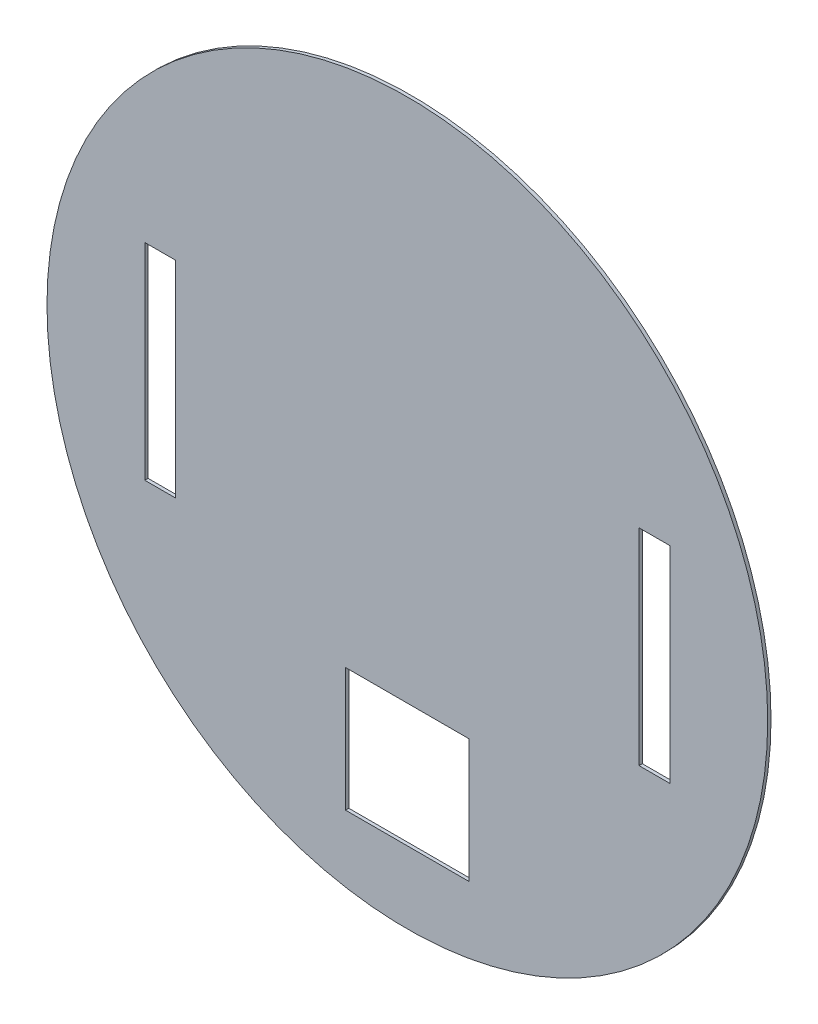
ISO-10303-21;
HEADER;
FILE_DESCRIPTION(('STEP AP214'),'2;1');
FILE_NAME('part.step','',(''),(''),'','','');
FILE_SCHEMA(('AUTOMOTIVE_DESIGN { 1 0 10303 214 1 1 1 1 }'));
ENDSEC;
DATA;
#1=APPLICATION_CONTEXT('core data for automotive mechanical design processes');
#2=APPLICATION_PROTOCOL_DEFINITION('international standard','automotive_design',2000,#1);
#3=PRODUCT_CONTEXT('',#1,'mechanical');
#4=PRODUCT('Part','Part','',(#3));
#5=PRODUCT_RELATED_PRODUCT_CATEGORY('part','',(#4));
#6=PRODUCT_DEFINITION_FORMATION('','',#4);
#7=PRODUCT_DEFINITION_CONTEXT('part definition',#1,'design');
#8=PRODUCT_DEFINITION('design','',#6,#7);
#9=PRODUCT_DEFINITION_SHAPE('','',#8);
#10=(LENGTH_UNIT() NAMED_UNIT(*) SI_UNIT(.MILLI.,.METRE.));
#11=(NAMED_UNIT(*) PLANE_ANGLE_UNIT() SI_UNIT($,.RADIAN.));
#12=(NAMED_UNIT(*) SI_UNIT($,.STERADIAN.) SOLID_ANGLE_UNIT());
#13=UNCERTAINTY_MEASURE_WITH_UNIT(LENGTH_MEASURE(1.E-05),#10,'distance_accuracy_value','');
#14=(GEOMETRIC_REPRESENTATION_CONTEXT(3) GLOBAL_UNCERTAINTY_ASSIGNED_CONTEXT((#13)) GLOBAL_UNIT_ASSIGNED_CONTEXT((#10,
#11,#12)) REPRESENTATION_CONTEXT('',''));
#15=CARTESIAN_POINT('',(0.,0.,0.));
#16=DIRECTION('',(0.,0.,1.));
#17=DIRECTION('',(1.,0.,0.));
#18=AXIS2_PLACEMENT_3D('',#15,#16,#17);
#19=CARTESIAN_POINT('',(0.,0.,1.6));
#20=DIRECTION('',(0.,0.,-1.));
#21=DIRECTION('',(-1.,0.,0.));
#22=AXIS2_PLACEMENT_3D('',#19,#20,#21);
#23=CYLINDRICAL_SURFACE('',#22,175.);
#24=CARTESIAN_POINT('',(0.,0.,1.6));
#25=DIRECTION('',(0.,0.,1.));
#26=DIRECTION('',(1.,0.,0.));
#27=AXIS2_PLACEMENT_3D('',#24,#25,#26);
#28=CIRCLE('',#27,175.);
#29=CARTESIAN_POINT('',(175.,0.,1.6));
#30=VERTEX_POINT('',#29);
#31=EDGE_CURVE('E11',#30,#30,#28,.T.);
#32=ORIENTED_EDGE('',*,*,#31,.F.);
#33=EDGE_LOOP('',(#32));
#34=FACE_BOUND('',#33,.T.);
#35=CARTESIAN_POINT('',(0.,0.,0.));
#36=DIRECTION('',(0.,0.,1.));
#37=DIRECTION('',(1.,0.,0.));
#38=AXIS2_PLACEMENT_3D('',#35,#36,#37);
#39=CIRCLE('',#38,175.);
#40=CARTESIAN_POINT('',(175.,0.,0.));
#41=VERTEX_POINT('',#40);
#42=EDGE_CURVE('E36',#41,#41,#39,.T.);
#43=ORIENTED_EDGE('',*,*,#42,.T.);
#44=EDGE_LOOP('',(#43));
#45=FACE_BOUND('',#44,.T.);
#46=ADVANCED_FACE('F33',(#34,#45),#23,.T.);
#47=CARTESIAN_POINT('',(0.,0.,1.6));
#48=DIRECTION('',(0.,0.,1.));
#49=DIRECTION('',(1.,0.,0.));
#50=AXIS2_PLACEMENT_3D('',#47,#48,#49);
#51=PLANE('',#50);
#52=DIRECTION('',(0.,-1.,0.));
#53=VECTOR('',#52,1.);
#54=CARTESIAN_POINT('',(-30.,-80.,1.6));
#55=LINE('',#54,#53);
#56=CARTESIAN_POINT('',(-30.,-80.,1.6));
#57=VERTEX_POINT('',#56);
#58=CARTESIAN_POINT('',(-30.,-140.,1.6));
#59=VERTEX_POINT('',#58);
#60=EDGE_CURVE('E47',#57,#59,#55,.T.);
#61=ORIENTED_EDGE('',*,*,#60,.F.);
#62=DIRECTION('',(-1.,0.,0.));
#63=VECTOR('',#62,1.);
#64=CARTESIAN_POINT('',(-30.,-80.,1.6));
#65=LINE('',#64,#63);
#66=CARTESIAN_POINT('',(30.,-80.,1.6));
#67=VERTEX_POINT('',#66);
#68=EDGE_CURVE('E139',#67,#57,#65,.T.);
#69=ORIENTED_EDGE('',*,*,#68,.F.);
#70=DIRECTION('',(0.,1.,0.));
#71=VECTOR('',#70,1.);
#72=CARTESIAN_POINT('',(30.,-80.,1.6));
#73=LINE('',#72,#71);
#74=CARTESIAN_POINT('',(30.,-140.,1.6));
#75=VERTEX_POINT('',#74);
#76=EDGE_CURVE('E142',#75,#67,#73,.T.);
#77=ORIENTED_EDGE('',*,*,#76,.F.);
#78=DIRECTION('',(1.,0.,0.));
#79=VECTOR('',#78,1.);
#80=CARTESIAN_POINT('',(-30.,-140.,1.6));
#81=LINE('',#80,#79);
#82=EDGE_CURVE('E148',#59,#75,#81,.T.);
#83=ORIENTED_EDGE('',*,*,#82,.F.);
#84=EDGE_LOOP('',(#61,#69,#77,#83));
#85=FACE_BOUND('',#84,.T.);
#86=DIRECTION('',(0.,-1.,0.));
#87=VECTOR('',#86,1.);
#88=CARTESIAN_POINT('',(-127.5,50.,1.6));
#89=LINE('',#88,#87);
#90=CARTESIAN_POINT('',(-127.5,50.,1.6));
#91=VERTEX_POINT('',#90);
#92=CARTESIAN_POINT('',(-127.5,-50.,1.6));
#93=VERTEX_POINT('',#92);
#94=EDGE_CURVE('E172',#91,#93,#89,.T.);
#95=ORIENTED_EDGE('',*,*,#94,.F.);
#96=DIRECTION('',(-1.,0.,0.));
#97=VECTOR('',#96,1.);
#98=CARTESIAN_POINT('',(-127.5,50.,1.6));
#99=LINE('',#98,#97);
#100=CARTESIAN_POINT('',(-112.5,50.,1.6));
#101=VERTEX_POINT('',#100);
#102=EDGE_CURVE('E162',#101,#91,#99,.T.);
#103=ORIENTED_EDGE('',*,*,#102,.F.);
#104=DIRECTION('',(0.,1.,0.));
#105=VECTOR('',#104,1.);
#106=CARTESIAN_POINT('',(-112.5,50.,1.6));
#107=LINE('',#106,#105);
#108=CARTESIAN_POINT('',(-112.5,-50.,1.6));
#109=VERTEX_POINT('',#108);
#110=EDGE_CURVE('E178',#109,#101,#107,.T.);
#111=ORIENTED_EDGE('',*,*,#110,.F.);
#112=DIRECTION('',(1.,0.,0.));
#113=VECTOR('',#112,1.);
#114=CARTESIAN_POINT('',(-127.5,-50.,1.6));
#115=LINE('',#114,#113);
#116=EDGE_CURVE('E174',#93,#109,#115,.T.);
#117=ORIENTED_EDGE('',*,*,#116,.F.);
#118=EDGE_LOOP('',(#95,#103,#111,#117));
#119=FACE_BOUND('',#118,.T.);
#120=DIRECTION('',(0.,1.,0.));
#121=VECTOR('',#120,1.);
#122=CARTESIAN_POINT('',(127.5,50.,1.6));
#123=LINE('',#122,#121);
#124=CARTESIAN_POINT('',(127.5,-50.,1.6));
#125=VERTEX_POINT('',#124);
#126=CARTESIAN_POINT('',(127.5,50.,1.6));
#127=VERTEX_POINT('',#126);
#128=EDGE_CURVE('E154',#125,#127,#123,.T.);
#129=ORIENTED_EDGE('',*,*,#128,.F.);
#130=DIRECTION('',(1.,0.,0.));
#131=VECTOR('',#130,1.);
#132=CARTESIAN_POINT('',(127.5,-50.,1.6));
#133=LINE('',#132,#131);
#134=CARTESIAN_POINT('',(112.5,-50.,1.6));
#135=VERTEX_POINT('',#134);
#136=EDGE_CURVE('E195',#135,#125,#133,.T.);
#137=ORIENTED_EDGE('',*,*,#136,.F.);
#138=DIRECTION('',(0.,-1.,0.));
#139=VECTOR('',#138,1.);
#140=CARTESIAN_POINT('',(112.5,50.,1.6));
#141=LINE('',#140,#139);
#142=CARTESIAN_POINT('',(112.5,50.,1.6));
#143=VERTEX_POINT('',#142);
#144=EDGE_CURVE('E209',#143,#135,#141,.T.);
#145=ORIENTED_EDGE('',*,*,#144,.F.);
#146=DIRECTION('',(-1.,0.,0.));
#147=VECTOR('',#146,1.);
#148=CARTESIAN_POINT('',(127.5,50.,1.6));
#149=LINE('',#148,#147);
#150=EDGE_CURVE('E206',#127,#143,#149,.T.);
#151=ORIENTED_EDGE('',*,*,#150,.F.);
#152=EDGE_LOOP('',(#129,#137,#145,#151));
#153=FACE_BOUND('',#152,.T.);
#154=ORIENTED_EDGE('',*,*,#31,.T.);
#155=EDGE_LOOP('',(#154));
#156=FACE_BOUND('',#155,.T.);
#157=ADVANCED_FACE('F230',(#85,#119,#153,#156),#51,.T.);
#158=CARTESIAN_POINT('',(0.,0.,0.));
#159=DIRECTION('',(0.,0.,1.));
#160=DIRECTION('',(1.,0.,0.));
#161=AXIS2_PLACEMENT_3D('',#158,#159,#160);
#162=PLANE('',#161);
#163=DIRECTION('',(-1.,0.,0.));
#164=VECTOR('',#163,1.);
#165=CARTESIAN_POINT('',(-30.,-80.,0.));
#166=LINE('',#165,#164);
#167=CARTESIAN_POINT('',(30.,-80.,0.));
#168=VERTEX_POINT('',#167);
#169=CARTESIAN_POINT('',(-30.,-80.,0.));
#170=VERTEX_POINT('',#169);
#171=EDGE_CURVE('E129',#168,#170,#166,.T.);
#172=ORIENTED_EDGE('',*,*,#171,.T.);
#173=DIRECTION('',(0.,-1.,0.));
#174=VECTOR('',#173,1.);
#175=CARTESIAN_POINT('',(-30.,-80.,0.));
#176=LINE('',#175,#174);
#177=CARTESIAN_POINT('',(-30.,-140.,0.));
#178=VERTEX_POINT('',#177);
#179=EDGE_CURVE('E123',#170,#178,#176,.T.);
#180=ORIENTED_EDGE('',*,*,#179,.T.);
#181=DIRECTION('',(1.,0.,0.));
#182=VECTOR('',#181,1.);
#183=CARTESIAN_POINT('',(-30.,-140.,0.));
#184=LINE('',#183,#182);
#185=CARTESIAN_POINT('',(30.,-140.,0.));
#186=VERTEX_POINT('',#185);
#187=EDGE_CURVE('E132',#178,#186,#184,.T.);
#188=ORIENTED_EDGE('',*,*,#187,.T.);
#189=DIRECTION('',(0.,1.,0.));
#190=VECTOR('',#189,1.);
#191=CARTESIAN_POINT('',(30.,-80.,0.));
#192=LINE('',#191,#190);
#193=EDGE_CURVE('E55',#186,#168,#192,.T.);
#194=ORIENTED_EDGE('',*,*,#193,.T.);
#195=EDGE_LOOP('',(#172,#180,#188,#194));
#196=FACE_BOUND('',#195,.T.);
#197=DIRECTION('',(-1.,0.,0.));
#198=VECTOR('',#197,1.);
#199=CARTESIAN_POINT('',(-127.5,50.,0.));
#200=LINE('',#199,#198);
#201=CARTESIAN_POINT('',(-112.5,50.,0.));
#202=VERTEX_POINT('',#201);
#203=CARTESIAN_POINT('',(-127.5,50.,0.));
#204=VERTEX_POINT('',#203);
#205=EDGE_CURVE('E168',#202,#204,#200,.T.);
#206=ORIENTED_EDGE('',*,*,#205,.T.);
#207=DIRECTION('',(0.,-1.,0.));
#208=VECTOR('',#207,1.);
#209=CARTESIAN_POINT('',(-127.5,50.,0.));
#210=LINE('',#209,#208);
#211=CARTESIAN_POINT('',(-127.5,-50.,0.));
#212=VERTEX_POINT('',#211);
#213=EDGE_CURVE('E158',#204,#212,#210,.T.);
#214=ORIENTED_EDGE('',*,*,#213,.T.);
#215=DIRECTION('',(1.,0.,0.));
#216=VECTOR('',#215,1.);
#217=CARTESIAN_POINT('',(-127.5,-50.,0.));
#218=LINE('',#217,#216);
#219=CARTESIAN_POINT('',(-112.5,-50.,0.));
#220=VERTEX_POINT('',#219);
#221=EDGE_CURVE('E161',#212,#220,#218,.T.);
#222=ORIENTED_EDGE('',*,*,#221,.T.);
#223=DIRECTION('',(0.,1.,0.));
#224=VECTOR('',#223,1.);
#225=CARTESIAN_POINT('',(-112.5,50.,0.));
#226=LINE('',#225,#224);
#227=EDGE_CURVE('E165',#220,#202,#226,.T.);
#228=ORIENTED_EDGE('',*,*,#227,.T.);
#229=EDGE_LOOP('',(#206,#214,#222,#228));
#230=FACE_BOUND('',#229,.T.);
#231=DIRECTION('',(1.,0.,0.));
#232=VECTOR('',#231,1.);
#233=CARTESIAN_POINT('',(127.5,-50.,0.));
#234=LINE('',#233,#232);
#235=CARTESIAN_POINT('',(112.5,-50.,0.));
#236=VERTEX_POINT('',#235);
#237=CARTESIAN_POINT('',(127.5,-50.,0.));
#238=VERTEX_POINT('',#237);
#239=EDGE_CURVE('E201',#236,#238,#234,.T.);
#240=ORIENTED_EDGE('',*,*,#239,.T.);
#241=DIRECTION('',(0.,1.,0.));
#242=VECTOR('',#241,1.);
#243=CARTESIAN_POINT('',(127.5,50.,0.));
#244=LINE('',#243,#242);
#245=CARTESIAN_POINT('',(127.5,50.,0.));
#246=VERTEX_POINT('',#245);
#247=EDGE_CURVE('E191',#238,#246,#244,.T.);
#248=ORIENTED_EDGE('',*,*,#247,.T.);
#249=DIRECTION('',(-1.,0.,0.));
#250=VECTOR('',#249,1.);
#251=CARTESIAN_POINT('',(127.5,50.,0.));
#252=LINE('',#251,#250);
#253=CARTESIAN_POINT('',(112.5,50.,0.));
#254=VERTEX_POINT('',#253);
#255=EDGE_CURVE('E194',#246,#254,#252,.T.);
#256=ORIENTED_EDGE('',*,*,#255,.T.);
#257=DIRECTION('',(0.,-1.,0.));
#258=VECTOR('',#257,1.);
#259=CARTESIAN_POINT('',(112.5,50.,0.));
#260=LINE('',#259,#258);
#261=EDGE_CURVE('E198',#254,#236,#260,.T.);
#262=ORIENTED_EDGE('',*,*,#261,.T.);
#263=EDGE_LOOP('',(#240,#248,#256,#262));
#264=FACE_BOUND('',#263,.T.);
#265=ORIENTED_EDGE('',*,*,#42,.F.);
#266=EDGE_LOOP('',(#265));
#267=FACE_BOUND('',#266,.T.);
#268=ADVANCED_FACE('F136',(#196,#230,#264,#267),#162,.F.);
#269=CARTESIAN_POINT('',(127.5,50.,0.));
#270=DIRECTION('',(1.,0.,0.));
#271=DIRECTION('',(0.,0.,-1.));
#272=AXIS2_PLACEMENT_3D('',#269,#270,#271);
#273=PLANE('',#272);
#274=ORIENTED_EDGE('',*,*,#128,.T.);
#275=DIRECTION('',(0.,0.,1.));
#276=VECTOR('',#275,1.);
#277=CARTESIAN_POINT('',(127.5,50.,0.));
#278=LINE('',#277,#276);
#279=EDGE_CURVE('E204',#246,#127,#278,.T.);
#280=ORIENTED_EDGE('',*,*,#279,.F.);
#281=ORIENTED_EDGE('',*,*,#247,.F.);
#282=DIRECTION('',(0.,0.,1.));
#283=VECTOR('',#282,1.);
#284=CARTESIAN_POINT('',(127.5,-50.,0.));
#285=LINE('',#284,#283);
#286=EDGE_CURVE('E175',#238,#125,#285,.T.);
#287=ORIENTED_EDGE('',*,*,#286,.T.);
#288=EDGE_LOOP('',(#274,#280,#281,#287));
#289=FACE_BOUND('',#288,.T.);
#290=ADVANCED_FACE('F238',(#289),#273,.F.);
#291=CARTESIAN_POINT('',(127.5,-50.,0.));
#292=DIRECTION('',(0.,-1.,0.));
#293=DIRECTION('',(0.,0.,-1.));
#294=AXIS2_PLACEMENT_3D('',#291,#292,#293);
#295=PLANE('',#294);
#296=ORIENTED_EDGE('',*,*,#136,.T.);
#297=ORIENTED_EDGE('',*,*,#286,.F.);
#298=ORIENTED_EDGE('',*,*,#239,.F.);
#299=DIRECTION('',(0.,0.,1.));
#300=VECTOR('',#299,1.);
#301=CARTESIAN_POINT('',(112.5,-50.,0.));
#302=LINE('',#301,#300);
#303=EDGE_CURVE('E215',#236,#135,#302,.T.);
#304=ORIENTED_EDGE('',*,*,#303,.T.);
#305=EDGE_LOOP('',(#296,#297,#298,#304));
#306=FACE_BOUND('',#305,.T.);
#307=ADVANCED_FACE('F240',(#306),#295,.F.);
#308=CARTESIAN_POINT('',(112.5,50.,0.));
#309=DIRECTION('',(-1.,0.,0.));
#310=DIRECTION('',(0.,0.,1.));
#311=AXIS2_PLACEMENT_3D('',#308,#309,#310);
#312=PLANE('',#311);
#313=ORIENTED_EDGE('',*,*,#144,.T.);
#314=ORIENTED_EDGE('',*,*,#303,.F.);
#315=ORIENTED_EDGE('',*,*,#261,.F.);
#316=DIRECTION('',(0.,0.,1.));
#317=VECTOR('',#316,1.);
#318=CARTESIAN_POINT('',(112.5,50.,0.));
#319=LINE('',#318,#317);
#320=EDGE_CURVE('E217',#254,#143,#319,.T.);
#321=ORIENTED_EDGE('',*,*,#320,.T.);
#322=EDGE_LOOP('',(#313,#314,#315,#321));
#323=FACE_BOUND('',#322,.T.);
#324=ADVANCED_FACE('F234',(#323),#312,.F.);
#325=CARTESIAN_POINT('',(127.5,50.,0.));
#326=DIRECTION('',(0.,1.,0.));
#327=DIRECTION('',(0.,0.,1.));
#328=AXIS2_PLACEMENT_3D('',#325,#326,#327);
#329=PLANE('',#328);
#330=ORIENTED_EDGE('',*,*,#150,.T.);
#331=ORIENTED_EDGE('',*,*,#320,.F.);
#332=ORIENTED_EDGE('',*,*,#255,.F.);
#333=ORIENTED_EDGE('',*,*,#279,.T.);
#334=EDGE_LOOP('',(#330,#331,#332,#333));
#335=FACE_BOUND('',#334,.T.);
#336=ADVANCED_FACE('F223',(#335),#329,.F.);
#337=CARTESIAN_POINT('',(-127.5,50.,0.));
#338=DIRECTION('',(-1.,0.,0.));
#339=DIRECTION('',(0.,0.,1.));
#340=AXIS2_PLACEMENT_3D('',#337,#338,#339);
#341=PLANE('',#340);
#342=ORIENTED_EDGE('',*,*,#94,.T.);
#343=DIRECTION('',(0.,0.,1.));
#344=VECTOR('',#343,1.);
#345=CARTESIAN_POINT('',(-127.5,-50.,0.));
#346=LINE('',#345,#344);
#347=EDGE_CURVE('E171',#212,#93,#346,.T.);
#348=ORIENTED_EDGE('',*,*,#347,.F.);
#349=ORIENTED_EDGE('',*,*,#213,.F.);
#350=DIRECTION('',(0.,0.,1.));
#351=VECTOR('',#350,1.);
#352=CARTESIAN_POINT('',(-127.5,50.,0.));
#353=LINE('',#352,#351);
#354=EDGE_CURVE('E183',#204,#91,#353,.T.);
#355=ORIENTED_EDGE('',*,*,#354,.T.);
#356=EDGE_LOOP('',(#342,#348,#349,#355));
#357=FACE_BOUND('',#356,.T.);
#358=ADVANCED_FACE('F268',(#357),#341,.F.);
#359=CARTESIAN_POINT('',(-127.5,50.,0.));
#360=DIRECTION('',(0.,1.,0.));
#361=DIRECTION('',(0.,0.,1.));
#362=AXIS2_PLACEMENT_3D('',#359,#360,#361);
#363=PLANE('',#362);
#364=ORIENTED_EDGE('',*,*,#102,.T.);
#365=ORIENTED_EDGE('',*,*,#354,.F.);
#366=ORIENTED_EDGE('',*,*,#205,.F.);
#367=DIRECTION('',(0.,0.,1.));
#368=VECTOR('',#367,1.);
#369=CARTESIAN_POINT('',(-112.5,50.,0.));
#370=LINE('',#369,#368);
#371=EDGE_CURVE('E185',#202,#101,#370,.T.);
#372=ORIENTED_EDGE('',*,*,#371,.T.);
#373=EDGE_LOOP('',(#364,#365,#366,#372));
#374=FACE_BOUND('',#373,.T.);
#375=ADVANCED_FACE('F272',(#374),#363,.F.);
#376=CARTESIAN_POINT('',(-112.5,50.,0.));
#377=DIRECTION('',(1.,0.,0.));
#378=DIRECTION('',(0.,0.,-1.));
#379=AXIS2_PLACEMENT_3D('',#376,#377,#378);
#380=PLANE('',#379);
#381=ORIENTED_EDGE('',*,*,#110,.T.);
#382=ORIENTED_EDGE('',*,*,#371,.F.);
#383=ORIENTED_EDGE('',*,*,#227,.F.);
#384=DIRECTION('',(0.,0.,1.));
#385=VECTOR('',#384,1.);
#386=CARTESIAN_POINT('',(-112.5,-50.,0.));
#387=LINE('',#386,#385);
#388=EDGE_CURVE('E187',#220,#109,#387,.T.);
#389=ORIENTED_EDGE('',*,*,#388,.T.);
#390=EDGE_LOOP('',(#381,#382,#383,#389));
#391=FACE_BOUND('',#390,.T.);
#392=ADVANCED_FACE('F277',(#391),#380,.F.);
#393=CARTESIAN_POINT('',(-127.5,-50.,0.));
#394=DIRECTION('',(0.,-1.,0.));
#395=DIRECTION('',(0.,0.,-1.));
#396=AXIS2_PLACEMENT_3D('',#393,#394,#395);
#397=PLANE('',#396);
#398=ORIENTED_EDGE('',*,*,#116,.T.);
#399=ORIENTED_EDGE('',*,*,#388,.F.);
#400=ORIENTED_EDGE('',*,*,#221,.F.);
#401=ORIENTED_EDGE('',*,*,#347,.T.);
#402=EDGE_LOOP('',(#398,#399,#400,#401));
#403=FACE_BOUND('',#402,.T.);
#404=ADVANCED_FACE('F281',(#403),#397,.F.);
#405=CARTESIAN_POINT('',(-30.,-80.,0.));
#406=DIRECTION('',(-1.,0.,0.));
#407=DIRECTION('',(0.,-1.,0.));
#408=AXIS2_PLACEMENT_3D('',#405,#406,#407);
#409=PLANE('',#408);
#410=ORIENTED_EDGE('',*,*,#60,.T.);
#411=DIRECTION('',(0.,0.,1.));
#412=VECTOR('',#411,1.);
#413=CARTESIAN_POINT('',(-30.,-140.,0.));
#414=LINE('',#413,#412);
#415=EDGE_CURVE('E119',#178,#59,#414,.T.);
#416=ORIENTED_EDGE('',*,*,#415,.F.);
#417=ORIENTED_EDGE('',*,*,#179,.F.);
#418=DIRECTION('',(0.,0.,1.));
#419=VECTOR('',#418,1.);
#420=CARTESIAN_POINT('',(-30.,-80.,0.));
#421=LINE('',#420,#419);
#422=EDGE_CURVE('E152',#170,#57,#421,.T.);
#423=ORIENTED_EDGE('',*,*,#422,.T.);
#424=EDGE_LOOP('',(#410,#416,#417,#423));
#425=FACE_BOUND('',#424,.T.);
#426=ADVANCED_FACE('F121',(#425),#409,.F.);
#427=CARTESIAN_POINT('',(-30.,-80.,0.));
#428=DIRECTION('',(0.,1.,0.));
#429=DIRECTION('',(0.,0.,1.));
#430=AXIS2_PLACEMENT_3D('',#427,#428,#429);
#431=PLANE('',#430);
#432=ORIENTED_EDGE('',*,*,#68,.T.);
#433=ORIENTED_EDGE('',*,*,#422,.F.);
#434=ORIENTED_EDGE('',*,*,#171,.F.);
#435=DIRECTION('',(0.,0.,1.));
#436=VECTOR('',#435,1.);
#437=CARTESIAN_POINT('',(30.,-80.,0.));
#438=LINE('',#437,#436);
#439=EDGE_CURVE('E155',#168,#67,#438,.T.);
#440=ORIENTED_EDGE('',*,*,#439,.T.);
#441=EDGE_LOOP('',(#432,#433,#434,#440));
#442=FACE_BOUND('',#441,.T.);
#443=ADVANCED_FACE('F290',(#442),#431,.F.);
#444=CARTESIAN_POINT('',(30.,-80.,0.));
#445=DIRECTION('',(1.,0.,0.));
#446=DIRECTION('',(0.,1.,0.));
#447=AXIS2_PLACEMENT_3D('',#444,#445,#446);
#448=PLANE('',#447);
#449=ORIENTED_EDGE('',*,*,#76,.T.);
#450=ORIENTED_EDGE('',*,*,#439,.F.);
#451=ORIENTED_EDGE('',*,*,#193,.F.);
#452=DIRECTION('',(0.,0.,1.));
#453=VECTOR('',#452,1.);
#454=CARTESIAN_POINT('',(30.,-140.,0.));
#455=LINE('',#454,#453);
#456=EDGE_CURVE('E128',#186,#75,#455,.T.);
#457=ORIENTED_EDGE('',*,*,#456,.T.);
#458=EDGE_LOOP('',(#449,#450,#451,#457));
#459=FACE_BOUND('',#458,.T.);
#460=ADVANCED_FACE('F293',(#459),#448,.F.);
#461=CARTESIAN_POINT('',(-30.,-140.,0.));
#462=DIRECTION('',(0.,-1.,0.));
#463=DIRECTION('',(0.,0.,-1.));
#464=AXIS2_PLACEMENT_3D('',#461,#462,#463);
#465=PLANE('',#464);
#466=ORIENTED_EDGE('',*,*,#82,.T.);
#467=ORIENTED_EDGE('',*,*,#456,.F.);
#468=ORIENTED_EDGE('',*,*,#187,.F.);
#469=ORIENTED_EDGE('',*,*,#415,.T.);
#470=EDGE_LOOP('',(#466,#467,#468,#469));
#471=FACE_BOUND('',#470,.T.);
#472=ADVANCED_FACE('F133',(#471),#465,.F.);
#473=CLOSED_SHELL('',(#46,#157,#268,#290,#307,#324,#336,#358,#375,#392,#404,#426,#443,#460,#472));
#474=MANIFOLD_SOLID_BREP('B2',#473);
#475=ADVANCED_BREP_SHAPE_REPRESENTATION('',(#18,#474),#14);
#476=SHAPE_DEFINITION_REPRESENTATION(#9,#475);
ENDSEC;
END-ISO-10303-21;
